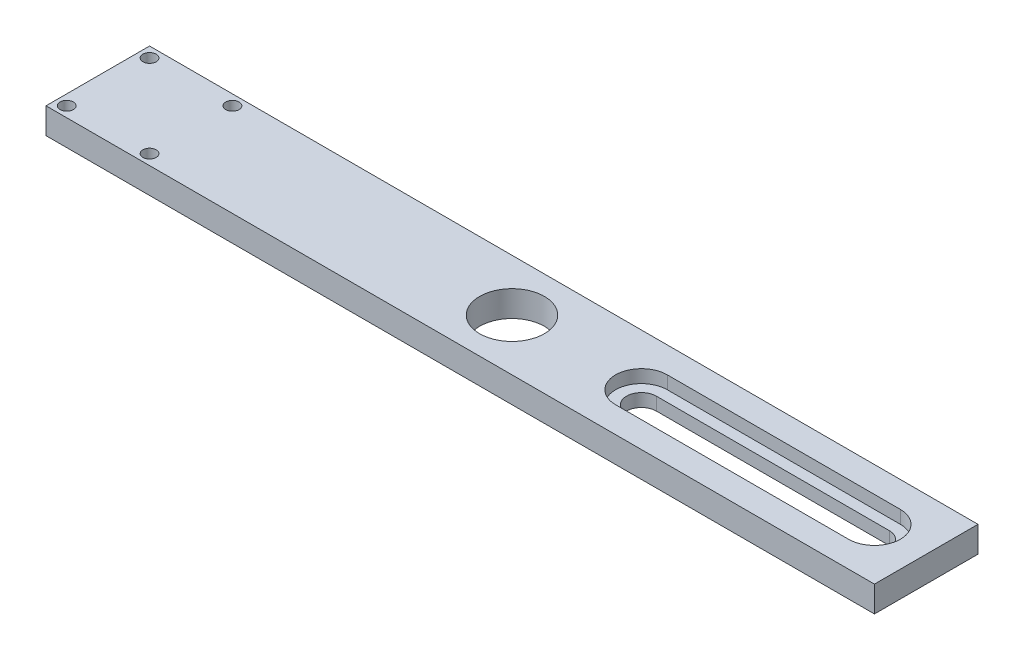
ISO-10303-21;
HEADER;
FILE_DESCRIPTION(('STEP AP214'),'2;1');
FILE_NAME('part.step','',(''),(''),'','','');
FILE_SCHEMA(('AUTOMOTIVE_DESIGN { 1 0 10303 214 1 1 1 1 }'));
ENDSEC;
DATA;
#1=APPLICATION_CONTEXT('core data for automotive mechanical design processes');
#2=APPLICATION_PROTOCOL_DEFINITION('international standard','automotive_design',2000,#1);
#3=PRODUCT_CONTEXT('',#1,'mechanical');
#4=PRODUCT('Part','Part','',(#3));
#5=PRODUCT_RELATED_PRODUCT_CATEGORY('part','',(#4));
#6=PRODUCT_DEFINITION_FORMATION('','',#4);
#7=PRODUCT_DEFINITION_CONTEXT('part definition',#1,'design');
#8=PRODUCT_DEFINITION('design','',#6,#7);
#9=PRODUCT_DEFINITION_SHAPE('','',#8);
#10=(LENGTH_UNIT() NAMED_UNIT(*) SI_UNIT(.MILLI.,.METRE.));
#11=(NAMED_UNIT(*) PLANE_ANGLE_UNIT() SI_UNIT($,.RADIAN.));
#12=(NAMED_UNIT(*) SI_UNIT($,.STERADIAN.) SOLID_ANGLE_UNIT());
#13=UNCERTAINTY_MEASURE_WITH_UNIT(LENGTH_MEASURE(1.E-05),#10,'distance_accuracy_value','');
#14=(GEOMETRIC_REPRESENTATION_CONTEXT(3) GLOBAL_UNCERTAINTY_ASSIGNED_CONTEXT((#13)) GLOBAL_UNIT_ASSIGNED_CONTEXT((#10,
#11,#12)) REPRESENTATION_CONTEXT('',''));
#15=CARTESIAN_POINT('',(0.,0.,0.));
#16=DIRECTION('',(0.,0.,1.));
#17=DIRECTION('',(1.,0.,0.));
#18=AXIS2_PLACEMENT_3D('',#15,#16,#17);
#19=CARTESIAN_POINT('',(133.35,0.,-12.7));
#20=DIRECTION('',(0.,1.,0.));
#21=DIRECTION('',(0.,0.,1.));
#22=AXIS2_PLACEMENT_3D('',#19,#20,#21);
#23=CYLINDRICAL_SURFACE('',#22,3.6576);
#24=CARTESIAN_POINT('',(133.35,3.175,-12.7));
#25=DIRECTION('',(0.,1.,0.));
#26=DIRECTION('',(0.,0.,1.));
#27=AXIS2_PLACEMENT_3D('',#24,#25,#26);
#28=CIRCLE('',#27,3.6576);
#29=CARTESIAN_POINT('',(133.35,3.175,-9.0424));
#30=VERTEX_POINT('',#29);
#31=CARTESIAN_POINT('',(133.35,3.175,-16.3576));
#32=VERTEX_POINT('',#31);
#33=EDGE_CURVE('E169',#30,#32,#28,.F.);
#34=ORIENTED_EDGE('',*,*,#33,.F.);
#35=DIRECTION('',(0.,1.,0.));
#36=VECTOR('',#35,1.);
#37=CARTESIAN_POINT('',(133.35,0.,-9.0424));
#38=LINE('',#37,#36);
#39=CARTESIAN_POINT('',(133.35,0.,-9.0424));
#40=VERTEX_POINT('',#39);
#41=EDGE_CURVE('E183',#40,#30,#38,.T.);
#42=ORIENTED_EDGE('',*,*,#41,.F.);
#43=CARTESIAN_POINT('',(133.35,0.,-12.7));
#44=DIRECTION('',(0.,1.,0.));
#45=DIRECTION('',(0.,0.,1.));
#46=AXIS2_PLACEMENT_3D('',#43,#44,#45);
#47=CIRCLE('',#46,3.6576);
#48=CARTESIAN_POINT('',(133.35,0.,-16.3576));
#49=VERTEX_POINT('',#48);
#50=EDGE_CURVE('E171',#49,#40,#47,.T.);
#51=ORIENTED_EDGE('',*,*,#50,.F.);
#52=DIRECTION('',(0.,1.,0.));
#53=VECTOR('',#52,1.);
#54=CARTESIAN_POINT('',(133.35,0.,-16.3576));
#55=LINE('',#54,#53);
#56=EDGE_CURVE('E184',#49,#32,#55,.T.);
#57=ORIENTED_EDGE('',*,*,#56,.T.);
#58=EDGE_LOOP('',(#34,#42,#51,#57));
#59=FACE_BOUND('',#58,.T.);
#60=ADVANCED_FACE('F37',(#59),#23,.F.);
#61=CARTESIAN_POINT('',(133.35,0.,-16.3576));
#62=DIRECTION('',(0.,0.,-1.));
#63=DIRECTION('',(-1.,0.,0.));
#64=AXIS2_PLACEMENT_3D('',#61,#62,#63);
#65=PLANE('',#64);
#66=DIRECTION('',(1.,0.,0.));
#67=VECTOR('',#66,1.);
#68=CARTESIAN_POINT('',(133.35,3.175,-16.3576));
#69=LINE('',#68,#67);
#70=CARTESIAN_POINT('',(190.5,3.175,-16.3576));
#71=VERTEX_POINT('',#70);
#72=EDGE_CURVE('E167',#32,#71,#69,.T.);
#73=ORIENTED_EDGE('',*,*,#72,.F.);
#74=ORIENTED_EDGE('',*,*,#56,.F.);
#75=DIRECTION('',(-1.,0.,0.));
#76=VECTOR('',#75,1.);
#77=CARTESIAN_POINT('',(133.35,0.,-16.3576));
#78=LINE('',#77,#76);
#79=CARTESIAN_POINT('',(190.5,0.,-16.3576));
#80=VERTEX_POINT('',#79);
#81=EDGE_CURVE('E180',#80,#49,#78,.T.);
#82=ORIENTED_EDGE('',*,*,#81,.F.);
#83=DIRECTION('',(0.,1.,0.));
#84=VECTOR('',#83,1.);
#85=CARTESIAN_POINT('',(190.5,0.,-16.3576));
#86=LINE('',#85,#84);
#87=EDGE_CURVE('E188',#80,#71,#86,.T.);
#88=ORIENTED_EDGE('',*,*,#87,.T.);
#89=EDGE_LOOP('',(#73,#74,#82,#88));
#90=FACE_BOUND('',#89,.T.);
#91=ADVANCED_FACE('F264',(#90),#65,.F.);
#92=CARTESIAN_POINT('',(190.5,0.,-12.7));
#93=DIRECTION('',(0.,1.,0.));
#94=DIRECTION('',(0.,0.,1.));
#95=AXIS2_PLACEMENT_3D('',#92,#93,#94);
#96=CYLINDRICAL_SURFACE('',#95,3.6576);
#97=CARTESIAN_POINT('',(190.5,3.175,-12.7));
#98=DIRECTION('',(0.,1.,0.));
#99=DIRECTION('',(0.,0.,1.));
#100=AXIS2_PLACEMENT_3D('',#97,#98,#99);
#101=CIRCLE('',#100,3.6576);
#102=CARTESIAN_POINT('',(190.5,3.175,-9.0424));
#103=VERTEX_POINT('',#102);
#104=EDGE_CURVE('E59',#71,#103,#101,.F.);
#105=ORIENTED_EDGE('',*,*,#104,.F.);
#106=ORIENTED_EDGE('',*,*,#87,.F.);
#107=CARTESIAN_POINT('',(190.5,0.,-12.7));
#108=DIRECTION('',(0.,1.,0.));
#109=DIRECTION('',(0.,0.,1.));
#110=AXIS2_PLACEMENT_3D('',#107,#108,#109);
#111=CIRCLE('',#110,3.6576);
#112=CARTESIAN_POINT('',(190.5,0.,-9.0424));
#113=VERTEX_POINT('',#112);
#114=EDGE_CURVE('E177',#113,#80,#111,.T.);
#115=ORIENTED_EDGE('',*,*,#114,.F.);
#116=DIRECTION('',(0.,1.,0.));
#117=VECTOR('',#116,1.);
#118=CARTESIAN_POINT('',(190.5,0.,-9.0424));
#119=LINE('',#118,#117);
#120=EDGE_CURVE('E191',#113,#103,#119,.T.);
#121=ORIENTED_EDGE('',*,*,#120,.T.);
#122=EDGE_LOOP('',(#105,#106,#115,#121));
#123=FACE_BOUND('',#122,.T.);
#124=ADVANCED_FACE('F270',(#123),#96,.F.);
#125=CARTESIAN_POINT('',(133.35,0.,-9.0424));
#126=DIRECTION('',(0.,0.,1.));
#127=DIRECTION('',(1.,0.,0.));
#128=AXIS2_PLACEMENT_3D('',#125,#126,#127);
#129=PLANE('',#128);
#130=DIRECTION('',(-1.,0.,0.));
#131=VECTOR('',#130,1.);
#132=CARTESIAN_POINT('',(133.35,3.175,-9.0424));
#133=LINE('',#132,#131);
#134=EDGE_CURVE('E11',#103,#30,#133,.T.);
#135=ORIENTED_EDGE('',*,*,#134,.F.);
#136=ORIENTED_EDGE('',*,*,#120,.F.);
#137=DIRECTION('',(1.,0.,0.));
#138=VECTOR('',#137,1.);
#139=CARTESIAN_POINT('',(133.35,0.,-9.0424));
#140=LINE('',#139,#138);
#141=EDGE_CURVE('E174',#40,#113,#140,.T.);
#142=ORIENTED_EDGE('',*,*,#141,.F.);
#143=ORIENTED_EDGE('',*,*,#41,.T.);
#144=EDGE_LOOP('',(#135,#136,#142,#143));
#145=FACE_BOUND('',#144,.T.);
#146=ADVANCED_FACE('F275',(#145),#129,.F.);
#147=CARTESIAN_POINT('',(0.,6.35,0.));
#148=DIRECTION('',(1.,0.,0.));
#149=DIRECTION('',(0.,0.,-1.));
#150=AXIS2_PLACEMENT_3D('',#147,#148,#149);
#151=PLANE('',#150);
#152=DIRECTION('',(0.,0.,1.));
#153=VECTOR('',#152,1.);
#154=CARTESIAN_POINT('',(0.,0.,0.));
#155=LINE('',#154,#153);
#156=CARTESIAN_POINT('',(0.,0.,-25.4));
#157=VERTEX_POINT('',#156);
#158=CARTESIAN_POINT('',(0.,0.,0.));
#159=VERTEX_POINT('',#158);
#160=EDGE_CURVE('E201',#157,#159,#155,.T.);
#161=ORIENTED_EDGE('',*,*,#160,.T.);
#162=DIRECTION('',(0.,-1.,0.));
#163=VECTOR('',#162,1.);
#164=CARTESIAN_POINT('',(0.,6.35,0.));
#165=LINE('',#164,#163);
#166=CARTESIAN_POINT('',(0.,6.35,0.));
#167=VERTEX_POINT('',#166);
#168=EDGE_CURVE('E45',#167,#159,#165,.T.);
#169=ORIENTED_EDGE('',*,*,#168,.F.);
#170=DIRECTION('',(0.,0.,1.));
#171=VECTOR('',#170,1.);
#172=CARTESIAN_POINT('',(0.,6.35,0.));
#173=LINE('',#172,#171);
#174=CARTESIAN_POINT('',(0.,6.35,-25.4));
#175=VERTEX_POINT('',#174);
#176=EDGE_CURVE('E202',#175,#167,#173,.T.);
#177=ORIENTED_EDGE('',*,*,#176,.F.);
#178=DIRECTION('',(0.,-1.,0.));
#179=VECTOR('',#178,1.);
#180=CARTESIAN_POINT('',(0.,6.35,-25.4));
#181=LINE('',#180,#179);
#182=EDGE_CURVE('E212',#175,#157,#181,.T.);
#183=ORIENTED_EDGE('',*,*,#182,.T.);
#184=EDGE_LOOP('',(#161,#169,#177,#183));
#185=FACE_BOUND('',#184,.T.);
#186=ADVANCED_FACE('F39',(#185),#151,.F.);
#187=CARTESIAN_POINT('',(0.,6.35,0.));
#188=DIRECTION('',(0.,0.,-1.));
#189=DIRECTION('',(-1.,0.,0.));
#190=AXIS2_PLACEMENT_3D('',#187,#188,#189);
#191=PLANE('',#190);
#192=DIRECTION('',(1.,0.,0.));
#193=VECTOR('',#192,1.);
#194=CARTESIAN_POINT('',(0.,0.,0.));
#195=LINE('',#194,#193);
#196=CARTESIAN_POINT('',(203.2,0.,0.));
#197=VERTEX_POINT('',#196);
#198=EDGE_CURVE('E215',#159,#197,#195,.T.);
#199=ORIENTED_EDGE('',*,*,#198,.T.);
#200=DIRECTION('',(0.,-1.,0.));
#201=VECTOR('',#200,1.);
#202=CARTESIAN_POINT('',(203.2,6.35,0.));
#203=LINE('',#202,#201);
#204=CARTESIAN_POINT('',(203.2,6.35,0.));
#205=VERTEX_POINT('',#204);
#206=EDGE_CURVE('E225',#205,#197,#203,.T.);
#207=ORIENTED_EDGE('',*,*,#206,.F.);
#208=DIRECTION('',(1.,0.,0.));
#209=VECTOR('',#208,1.);
#210=CARTESIAN_POINT('',(0.,6.35,0.));
#211=LINE('',#210,#209);
#212=EDGE_CURVE('E205',#167,#205,#211,.T.);
#213=ORIENTED_EDGE('',*,*,#212,.F.);
#214=ORIENTED_EDGE('',*,*,#168,.T.);
#215=EDGE_LOOP('',(#199,#207,#213,#214));
#216=FACE_BOUND('',#215,.T.);
#217=ADVANCED_FACE('F230',(#216),#191,.F.);
#218=CARTESIAN_POINT('',(203.2,6.35,0.));
#219=DIRECTION('',(-1.,0.,0.));
#220=DIRECTION('',(0.,0.,1.));
#221=AXIS2_PLACEMENT_3D('',#218,#219,#220);
#222=PLANE('',#221);
#223=DIRECTION('',(0.,0.,-1.));
#224=VECTOR('',#223,1.);
#225=CARTESIAN_POINT('',(203.2,0.,0.));
#226=LINE('',#225,#224);
#227=CARTESIAN_POINT('',(203.2,0.,-25.4));
#228=VERTEX_POINT('',#227);
#229=EDGE_CURVE('E217',#197,#228,#226,.T.);
#230=ORIENTED_EDGE('',*,*,#229,.T.);
#231=DIRECTION('',(0.,-1.,0.));
#232=VECTOR('',#231,1.);
#233=CARTESIAN_POINT('',(203.2,6.35,-25.4));
#234=LINE('',#233,#232);
#235=CARTESIAN_POINT('',(203.2,6.35,-25.4));
#236=VERTEX_POINT('',#235);
#237=EDGE_CURVE('E222',#236,#228,#234,.T.);
#238=ORIENTED_EDGE('',*,*,#237,.F.);
#239=DIRECTION('',(0.,0.,-1.));
#240=VECTOR('',#239,1.);
#241=CARTESIAN_POINT('',(203.2,6.35,0.));
#242=LINE('',#241,#240);
#243=EDGE_CURVE('E208',#205,#236,#242,.T.);
#244=ORIENTED_EDGE('',*,*,#243,.F.);
#245=ORIENTED_EDGE('',*,*,#206,.T.);
#246=EDGE_LOOP('',(#230,#238,#244,#245));
#247=FACE_BOUND('',#246,.T.);
#248=ADVANCED_FACE('F242',(#247),#222,.F.);
#249=CARTESIAN_POINT('',(0.,6.35,-25.4));
#250=DIRECTION('',(0.,0.,1.));
#251=DIRECTION('',(1.,0.,0.));
#252=AXIS2_PLACEMENT_3D('',#249,#250,#251);
#253=PLANE('',#252);
#254=DIRECTION('',(-1.,0.,0.));
#255=VECTOR('',#254,1.);
#256=CARTESIAN_POINT('',(0.,0.,-25.4));
#257=LINE('',#256,#255);
#258=EDGE_CURVE('E206',#228,#157,#257,.T.);
#259=ORIENTED_EDGE('',*,*,#258,.T.);
#260=ORIENTED_EDGE('',*,*,#182,.F.);
#261=DIRECTION('',(-1.,0.,0.));
#262=VECTOR('',#261,1.);
#263=CARTESIAN_POINT('',(0.,6.35,-25.4));
#264=LINE('',#263,#262);
#265=EDGE_CURVE('E210',#236,#175,#264,.T.);
#266=ORIENTED_EDGE('',*,*,#265,.F.);
#267=ORIENTED_EDGE('',*,*,#237,.T.);
#268=EDGE_LOOP('',(#259,#260,#266,#267));
#269=FACE_BOUND('',#268,.T.);
#270=ADVANCED_FACE('F246',(#269),#253,.F.);
#271=CARTESIAN_POINT('',(0.,6.35,0.));
#272=DIRECTION('',(0.,-1.,0.));
#273=DIRECTION('',(0.,0.,-1.));
#274=AXIS2_PLACEMENT_3D('',#271,#272,#273);
#275=PLANE('',#274);
#276=CARTESIAN_POINT('',(2.53999999999999,6.35,-22.86));
#277=DIRECTION('',(0.,1.,0.));
#278=DIRECTION('',(0.,0.,1.));
#279=AXIS2_PLACEMENT_3D('',#276,#277,#278);
#280=CIRCLE('',#279,1.63194999999999);
#281=CARTESIAN_POINT('',(2.53999999999999,6.35,-21.22805));
#282=VERTEX_POINT('',#281);
#283=EDGE_CURVE('E439',#282,#282,#280,.T.);
#284=ORIENTED_EDGE('',*,*,#283,.F.);
#285=EDGE_LOOP('',(#284));
#286=FACE_BOUND('',#285,.T.);
#287=CARTESIAN_POINT('',(22.86,6.35,-22.86));
#288=DIRECTION('',(0.,1.,0.));
#289=DIRECTION('',(0.,0.,1.));
#290=AXIS2_PLACEMENT_3D('',#287,#288,#289);
#291=CIRCLE('',#290,1.63194999999999);
#292=CARTESIAN_POINT('',(22.86,6.35,-21.22805));
#293=VERTEX_POINT('',#292);
#294=EDGE_CURVE('E441',#293,#293,#291,.T.);
#295=ORIENTED_EDGE('',*,*,#294,.F.);
#296=EDGE_LOOP('',(#295));
#297=FACE_BOUND('',#296,.T.);
#298=CARTESIAN_POINT('',(22.86,6.35,-2.54));
#299=DIRECTION('',(0.,1.,0.));
#300=DIRECTION('',(0.,0.,1.));
#301=AXIS2_PLACEMENT_3D('',#298,#299,#300);
#302=CIRCLE('',#301,1.63194999999999);
#303=CARTESIAN_POINT('',(22.86,6.35,-0.908050000000014));
#304=VERTEX_POINT('',#303);
#305=EDGE_CURVE('E449',#304,#304,#302,.T.);
#306=ORIENTED_EDGE('',*,*,#305,.F.);
#307=EDGE_LOOP('',(#306));
#308=FACE_BOUND('',#307,.T.);
#309=CARTESIAN_POINT('',(2.53999999999999,6.35,-2.54));
#310=DIRECTION('',(0.,1.,0.));
#311=DIRECTION('',(0.,0.,1.));
#312=AXIS2_PLACEMENT_3D('',#309,#310,#311);
#313=CIRCLE('',#312,1.63194999999999);
#314=CARTESIAN_POINT('',(2.53999999999999,6.35,-0.908050000000012));
#315=VERTEX_POINT('',#314);
#316=EDGE_CURVE('E454',#315,#315,#313,.T.);
#317=ORIENTED_EDGE('',*,*,#316,.F.);
#318=EDGE_LOOP('',(#317));
#319=FACE_BOUND('',#318,.T.);
#320=DIRECTION('',(-1.,0.,0.));
#321=VECTOR('',#320,1.);
#322=CARTESIAN_POINT('',(190.5,6.35,-19.05));
#323=LINE('',#322,#321);
#324=CARTESIAN_POINT('',(190.5,6.35,-19.05));
#325=VERTEX_POINT('',#324);
#326=CARTESIAN_POINT('',(133.35,6.35,-19.05));
#327=VERTEX_POINT('',#326);
#328=EDGE_CURVE('E157',#325,#327,#323,.T.);
#329=ORIENTED_EDGE('',*,*,#328,.F.);
#330=CARTESIAN_POINT('',(190.5,6.35,-12.7));
#331=DIRECTION('',(0.,1.,0.));
#332=DIRECTION('',(0.,0.,1.));
#333=AXIS2_PLACEMENT_3D('',#330,#331,#332);
#334=CIRCLE('',#333,6.35);
#335=CARTESIAN_POINT('',(190.5,6.35,-6.35));
#336=VERTEX_POINT('',#335);
#337=EDGE_CURVE('E52',#336,#325,#334,.T.);
#338=ORIENTED_EDGE('',*,*,#337,.F.);
#339=DIRECTION('',(1.,0.,0.));
#340=VECTOR('',#339,1.);
#341=CARTESIAN_POINT('',(190.5,6.35,-6.35));
#342=LINE('',#341,#340);
#343=CARTESIAN_POINT('',(133.35,6.35,-6.34999999999999));
#344=VERTEX_POINT('',#343);
#345=EDGE_CURVE('E145',#344,#336,#342,.T.);
#346=ORIENTED_EDGE('',*,*,#345,.F.);
#347=CARTESIAN_POINT('',(133.35,6.35,-12.7));
#348=DIRECTION('',(0.,1.,0.));
#349=DIRECTION('',(0.,0.,1.));
#350=AXIS2_PLACEMENT_3D('',#347,#348,#349);
#351=CIRCLE('',#350,6.35);
#352=EDGE_CURVE('E148',#327,#344,#351,.T.);
#353=ORIENTED_EDGE('',*,*,#352,.F.);
#354=EDGE_LOOP('',(#329,#338,#346,#353));
#355=FACE_BOUND('',#354,.T.);
#356=CARTESIAN_POINT('',(101.6,6.35,-12.7));
#357=DIRECTION('',(0.,1.,0.));
#358=DIRECTION('',(0.,0.,1.));
#359=AXIS2_PLACEMENT_3D('',#356,#357,#358);
#360=CIRCLE('',#359,7.93749999999999);
#361=CARTESIAN_POINT('',(101.6,6.35,-4.76250000000001));
#362=VERTEX_POINT('',#361);
#363=EDGE_CURVE('E187',#362,#362,#360,.T.);
#364=ORIENTED_EDGE('',*,*,#363,.F.);
#365=EDGE_LOOP('',(#364));
#366=FACE_BOUND('',#365,.T.);
#367=ORIENTED_EDGE('',*,*,#176,.T.);
#368=ORIENTED_EDGE('',*,*,#212,.T.);
#369=ORIENTED_EDGE('',*,*,#243,.T.);
#370=ORIENTED_EDGE('',*,*,#265,.T.);
#371=EDGE_LOOP('',(#367,#368,#369,#370));
#372=FACE_BOUND('',#371,.T.);
#373=ADVANCED_FACE('F248',(#286,#297,#308,#319,#355,#366,#372),#275,.F.);
#374=CARTESIAN_POINT('',(0.,0.,0.));
#375=DIRECTION('',(0.,-1.,0.));
#376=DIRECTION('',(0.,0.,-1.));
#377=AXIS2_PLACEMENT_3D('',#374,#375,#376);
#378=PLANE('',#377);
#379=CARTESIAN_POINT('',(2.53999999999999,0.,-22.86));
#380=DIRECTION('',(0.,1.,0.));
#381=DIRECTION('',(0.,0.,1.));
#382=AXIS2_PLACEMENT_3D('',#379,#380,#381);
#383=CIRCLE('',#382,1.63195);
#384=CARTESIAN_POINT('',(2.53999999999999,0.,-21.22805));
#385=VERTEX_POINT('',#384);
#386=EDGE_CURVE('E437',#385,#385,#383,.T.);
#387=ORIENTED_EDGE('',*,*,#386,.T.);
#388=EDGE_LOOP('',(#387));
#389=FACE_BOUND('',#388,.T.);
#390=CARTESIAN_POINT('',(22.86,0.,-22.86));
#391=DIRECTION('',(0.,1.,0.));
#392=DIRECTION('',(0.,0.,1.));
#393=AXIS2_PLACEMENT_3D('',#390,#391,#392);
#394=CIRCLE('',#393,1.63195);
#395=CARTESIAN_POINT('',(22.86,0.,-21.22805));
#396=VERTEX_POINT('',#395);
#397=EDGE_CURVE('E446',#396,#396,#394,.T.);
#398=ORIENTED_EDGE('',*,*,#397,.T.);
#399=EDGE_LOOP('',(#398));
#400=FACE_BOUND('',#399,.T.);
#401=CARTESIAN_POINT('',(22.86,0.,-2.54));
#402=DIRECTION('',(0.,1.,0.));
#403=DIRECTION('',(0.,0.,1.));
#404=AXIS2_PLACEMENT_3D('',#401,#402,#403);
#405=CIRCLE('',#404,1.63195);
#406=CARTESIAN_POINT('',(22.86,0.,-0.908050000000004));
#407=VERTEX_POINT('',#406);
#408=EDGE_CURVE('E452',#407,#407,#405,.T.);
#409=ORIENTED_EDGE('',*,*,#408,.T.);
#410=EDGE_LOOP('',(#409));
#411=FACE_BOUND('',#410,.T.);
#412=CARTESIAN_POINT('',(2.53999999999999,0.,-2.54));
#413=DIRECTION('',(0.,1.,0.));
#414=DIRECTION('',(0.,0.,1.));
#415=AXIS2_PLACEMENT_3D('',#412,#413,#414);
#416=CIRCLE('',#415,1.63195);
#417=CARTESIAN_POINT('',(2.53999999999999,0.,-0.908050000000004));
#418=VERTEX_POINT('',#417);
#419=EDGE_CURVE('E151',#418,#418,#416,.T.);
#420=ORIENTED_EDGE('',*,*,#419,.T.);
#421=EDGE_LOOP('',(#420));
#422=FACE_BOUND('',#421,.T.);
#423=ORIENTED_EDGE('',*,*,#50,.T.);
#424=ORIENTED_EDGE('',*,*,#141,.T.);
#425=ORIENTED_EDGE('',*,*,#114,.T.);
#426=ORIENTED_EDGE('',*,*,#81,.T.);
#427=EDGE_LOOP('',(#423,#424,#425,#426));
#428=FACE_BOUND('',#427,.T.);
#429=CARTESIAN_POINT('',(101.6,0.,-12.7));
#430=DIRECTION('',(0.,-1.,0.));
#431=DIRECTION('',(0.,0.,-1.));
#432=AXIS2_PLACEMENT_3D('',#429,#430,#431);
#433=CIRCLE('',#432,7.93749999999999);
#434=CARTESIAN_POINT('',(101.6,0.,-20.6375));
#435=VERTEX_POINT('',#434);
#436=EDGE_CURVE('E198',#435,#435,#433,.T.);
#437=ORIENTED_EDGE('',*,*,#436,.F.);
#438=EDGE_LOOP('',(#437));
#439=FACE_BOUND('',#438,.T.);
#440=ORIENTED_EDGE('',*,*,#160,.F.);
#441=ORIENTED_EDGE('',*,*,#258,.F.);
#442=ORIENTED_EDGE('',*,*,#229,.F.);
#443=ORIENTED_EDGE('',*,*,#198,.F.);
#444=EDGE_LOOP('',(#440,#441,#442,#443));
#445=FACE_BOUND('',#444,.T.);
#446=ADVANCED_FACE('F238',(#389,#400,#411,#422,#428,#439,#445),#378,.T.);
#447=CARTESIAN_POINT('',(101.6,6.35,-12.7));
#448=DIRECTION('',(0.,1.,0.));
#449=DIRECTION('',(0.,0.,1.));
#450=AXIS2_PLACEMENT_3D('',#447,#448,#449);
#451=CYLINDRICAL_SURFACE('',#450,7.93749999999999);
#452=ORIENTED_EDGE('',*,*,#436,.T.);
#453=EDGE_LOOP('',(#452));
#454=FACE_BOUND('',#453,.T.);
#455=ORIENTED_EDGE('',*,*,#363,.T.);
#456=EDGE_LOOP('',(#455));
#457=FACE_BOUND('',#456,.T.);
#458=ADVANCED_FACE('F256',(#454,#457),#451,.F.);
#459=CARTESIAN_POINT('',(190.5,3.175,-12.7));
#460=DIRECTION('',(0.,1.,0.));
#461=DIRECTION('',(0.,0.,1.));
#462=AXIS2_PLACEMENT_3D('',#459,#460,#461);
#463=PLANE('',#462);
#464=CARTESIAN_POINT('',(190.5,3.175,-12.7));
#465=DIRECTION('',(0.,1.,0.));
#466=DIRECTION('',(0.,0.,1.));
#467=AXIS2_PLACEMENT_3D('',#464,#465,#466);
#468=CIRCLE('',#467,6.35);
#469=CARTESIAN_POINT('',(190.5,3.175,-6.35));
#470=VERTEX_POINT('',#469);
#471=CARTESIAN_POINT('',(190.5,3.175,-19.05));
#472=VERTEX_POINT('',#471);
#473=EDGE_CURVE('E127',#470,#472,#468,.T.);
#474=ORIENTED_EDGE('',*,*,#473,.T.);
#475=DIRECTION('',(-1.,0.,0.));
#476=VECTOR('',#475,1.);
#477=CARTESIAN_POINT('',(190.5,3.175,-19.05));
#478=LINE('',#477,#476);
#479=CARTESIAN_POINT('',(133.35,3.175,-19.05));
#480=VERTEX_POINT('',#479);
#481=EDGE_CURVE('E136',#472,#480,#478,.T.);
#482=ORIENTED_EDGE('',*,*,#481,.T.);
#483=CARTESIAN_POINT('',(133.35,3.175,-12.7));
#484=DIRECTION('',(0.,1.,0.));
#485=DIRECTION('',(0.,0.,1.));
#486=AXIS2_PLACEMENT_3D('',#483,#484,#485);
#487=CIRCLE('',#486,6.35);
#488=CARTESIAN_POINT('',(133.35,3.175,-6.34999999999999));
#489=VERTEX_POINT('',#488);
#490=EDGE_CURVE('E141',#480,#489,#487,.T.);
#491=ORIENTED_EDGE('',*,*,#490,.T.);
#492=DIRECTION('',(1.,0.,0.));
#493=VECTOR('',#492,1.);
#494=CARTESIAN_POINT('',(190.5,3.175,-6.35));
#495=LINE('',#494,#493);
#496=EDGE_CURVE('E133',#489,#470,#495,.T.);
#497=ORIENTED_EDGE('',*,*,#496,.T.);
#498=EDGE_LOOP('',(#474,#482,#491,#497));
#499=FACE_BOUND('',#498,.T.);
#500=ORIENTED_EDGE('',*,*,#33,.T.);
#501=ORIENTED_EDGE('',*,*,#72,.T.);
#502=ORIENTED_EDGE('',*,*,#104,.T.);
#503=ORIENTED_EDGE('',*,*,#134,.T.);
#504=EDGE_LOOP('',(#500,#501,#502,#503));
#505=FACE_BOUND('',#504,.T.);
#506=ADVANCED_FACE('F143',(#499,#505),#463,.T.);
#507=CARTESIAN_POINT('',(190.5,3.175,-12.7));
#508=DIRECTION('',(0.,1.,0.));
#509=DIRECTION('',(0.,0.,1.));
#510=AXIS2_PLACEMENT_3D('',#507,#508,#509);
#511=CYLINDRICAL_SURFACE('',#510,6.35);
#512=ORIENTED_EDGE('',*,*,#337,.T.);
#513=DIRECTION('',(0.,1.,0.));
#514=VECTOR('',#513,1.);
#515=CARTESIAN_POINT('',(190.5,3.175,-19.05));
#516=LINE('',#515,#514);
#517=EDGE_CURVE('E123',#472,#325,#516,.T.);
#518=ORIENTED_EDGE('',*,*,#517,.F.);
#519=ORIENTED_EDGE('',*,*,#473,.F.);
#520=DIRECTION('',(0.,1.,0.));
#521=VECTOR('',#520,1.);
#522=CARTESIAN_POINT('',(190.5,3.175,-6.35));
#523=LINE('',#522,#521);
#524=EDGE_CURVE('E161',#470,#336,#523,.T.);
#525=ORIENTED_EDGE('',*,*,#524,.T.);
#526=EDGE_LOOP('',(#512,#518,#519,#525));
#527=FACE_BOUND('',#526,.T.);
#528=ADVANCED_FACE('F125',(#527),#511,.F.);
#529=CARTESIAN_POINT('',(190.5,3.175,-6.35));
#530=DIRECTION('',(0.,0.,1.));
#531=DIRECTION('',(1.,0.,0.));
#532=AXIS2_PLACEMENT_3D('',#529,#530,#531);
#533=PLANE('',#532);
#534=ORIENTED_EDGE('',*,*,#345,.T.);
#535=ORIENTED_EDGE('',*,*,#524,.F.);
#536=ORIENTED_EDGE('',*,*,#496,.F.);
#537=DIRECTION('',(0.,1.,0.));
#538=VECTOR('',#537,1.);
#539=CARTESIAN_POINT('',(133.35,3.175,-6.34999999999999));
#540=LINE('',#539,#538);
#541=EDGE_CURVE('E163',#489,#344,#540,.T.);
#542=ORIENTED_EDGE('',*,*,#541,.T.);
#543=EDGE_LOOP('',(#534,#535,#536,#542));
#544=FACE_BOUND('',#543,.T.);
#545=ADVANCED_FACE('F291',(#544),#533,.F.);
#546=CARTESIAN_POINT('',(133.35,3.175,-12.7));
#547=DIRECTION('',(0.,1.,0.));
#548=DIRECTION('',(0.,0.,1.));
#549=AXIS2_PLACEMENT_3D('',#546,#547,#548);
#550=CYLINDRICAL_SURFACE('',#549,6.35);
#551=ORIENTED_EDGE('',*,*,#352,.T.);
#552=ORIENTED_EDGE('',*,*,#541,.F.);
#553=ORIENTED_EDGE('',*,*,#490,.F.);
#554=DIRECTION('',(0.,1.,0.));
#555=VECTOR('',#554,1.);
#556=CARTESIAN_POINT('',(133.35,3.175,-19.05));
#557=LINE('',#556,#555);
#558=EDGE_CURVE('E132',#480,#327,#557,.T.);
#559=ORIENTED_EDGE('',*,*,#558,.T.);
#560=EDGE_LOOP('',(#551,#552,#553,#559));
#561=FACE_BOUND('',#560,.T.);
#562=ADVANCED_FACE('F299',(#561),#550,.F.);
#563=CARTESIAN_POINT('',(190.5,3.175,-19.05));
#564=DIRECTION('',(0.,0.,-1.));
#565=DIRECTION('',(-1.,0.,0.));
#566=AXIS2_PLACEMENT_3D('',#563,#564,#565);
#567=PLANE('',#566);
#568=ORIENTED_EDGE('',*,*,#328,.T.);
#569=ORIENTED_EDGE('',*,*,#558,.F.);
#570=ORIENTED_EDGE('',*,*,#481,.F.);
#571=ORIENTED_EDGE('',*,*,#517,.T.);
#572=EDGE_LOOP('',(#568,#569,#570,#571));
#573=FACE_BOUND('',#572,.T.);
#574=ADVANCED_FACE('F137',(#573),#567,.F.);
#575=CARTESIAN_POINT('',(2.53999999999999,6.35,-2.54));
#576=DIRECTION('',(0.,1.,0.));
#577=DIRECTION('',(0.,0.,1.));
#578=AXIS2_PLACEMENT_3D('',#575,#576,#577);
#579=CYLINDRICAL_SURFACE('',#578,1.63194999999999);
#580=ORIENTED_EDGE('',*,*,#419,.F.);
#581=EDGE_LOOP('',(#580));
#582=FACE_BOUND('',#581,.T.);
#583=ORIENTED_EDGE('',*,*,#316,.T.);
#584=EDGE_LOOP('',(#583));
#585=FACE_BOUND('',#584,.T.);
#586=ADVANCED_FACE('F295',(#582,#585),#579,.F.);
#587=CARTESIAN_POINT('',(22.86,6.35,-2.54));
#588=DIRECTION('',(0.,1.,0.));
#589=DIRECTION('',(0.,0.,1.));
#590=AXIS2_PLACEMENT_3D('',#587,#588,#589);
#591=CYLINDRICAL_SURFACE('',#590,1.63194999999999);
#592=ORIENTED_EDGE('',*,*,#408,.F.);
#593=EDGE_LOOP('',(#592));
#594=FACE_BOUND('',#593,.T.);
#595=ORIENTED_EDGE('',*,*,#305,.T.);
#596=EDGE_LOOP('',(#595));
#597=FACE_BOUND('',#596,.T.);
#598=ADVANCED_FACE('F402',(#594,#597),#591,.F.);
#599=CARTESIAN_POINT('',(22.86,6.35,-22.86));
#600=DIRECTION('',(0.,1.,0.));
#601=DIRECTION('',(0.,0.,1.));
#602=AXIS2_PLACEMENT_3D('',#599,#600,#601);
#603=CYLINDRICAL_SURFACE('',#602,1.63194999999999);
#604=ORIENTED_EDGE('',*,*,#397,.F.);
#605=EDGE_LOOP('',(#604));
#606=FACE_BOUND('',#605,.T.);
#607=ORIENTED_EDGE('',*,*,#294,.T.);
#608=EDGE_LOOP('',(#607));
#609=FACE_BOUND('',#608,.T.);
#610=ADVANCED_FACE('F411',(#606,#609),#603,.F.);
#611=CARTESIAN_POINT('',(2.53999999999999,6.35,-22.86));
#612=DIRECTION('',(0.,1.,0.));
#613=DIRECTION('',(0.,0.,1.));
#614=AXIS2_PLACEMENT_3D('',#611,#612,#613);
#615=CYLINDRICAL_SURFACE('',#614,1.63194999999999);
#616=ORIENTED_EDGE('',*,*,#386,.F.);
#617=EDGE_LOOP('',(#616));
#618=FACE_BOUND('',#617,.T.);
#619=ORIENTED_EDGE('',*,*,#283,.T.);
#620=EDGE_LOOP('',(#619));
#621=FACE_BOUND('',#620,.T.);
#622=ADVANCED_FACE('F420',(#618,#621),#615,.F.);
#623=CLOSED_SHELL('',(#60,#91,#124,#146,#186,#217,#248,#270,#373,#446,#458,#506,#528,#545,#562,
#574,#586,#598,#610,#622));
#624=MANIFOLD_SOLID_BREP('B2',#623);
#625=ADVANCED_BREP_SHAPE_REPRESENTATION('',(#18,#624),#14);
#626=SHAPE_DEFINITION_REPRESENTATION(#9,#625);
ENDSEC;
END-ISO-10303-21;
